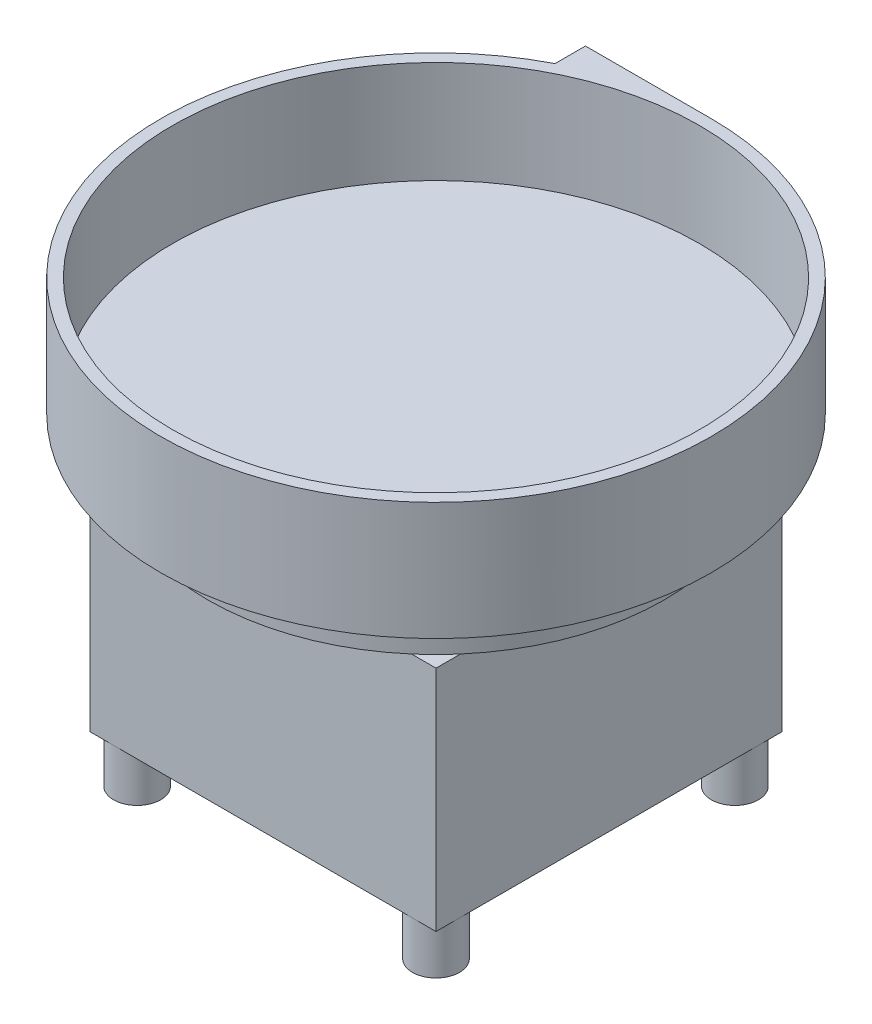
ISO-10303-21;
HEADER;
FILE_DESCRIPTION(('STEP AP214'),'2;1');
FILE_NAME('part.step','',(''),(''),'','','');
FILE_SCHEMA(('AUTOMOTIVE_DESIGN { 1 0 10303 214 1 1 1 1 }'));
ENDSEC;
DATA;
#1=APPLICATION_CONTEXT('core data for automotive mechanical design processes');
#2=APPLICATION_PROTOCOL_DEFINITION('international standard','automotive_design',2000,#1);
#3=PRODUCT_CONTEXT('',#1,'mechanical');
#4=PRODUCT('Part','Part','',(#3));
#5=PRODUCT_RELATED_PRODUCT_CATEGORY('part','',(#4));
#6=PRODUCT_DEFINITION_FORMATION('','',#4);
#7=PRODUCT_DEFINITION_CONTEXT('part definition',#1,'design');
#8=PRODUCT_DEFINITION('design','',#6,#7);
#9=PRODUCT_DEFINITION_SHAPE('','',#8);
#10=(LENGTH_UNIT() NAMED_UNIT(*) SI_UNIT(.MILLI.,.METRE.));
#11=(NAMED_UNIT(*) PLANE_ANGLE_UNIT() SI_UNIT($,.RADIAN.));
#12=(NAMED_UNIT(*) SI_UNIT($,.STERADIAN.) SOLID_ANGLE_UNIT());
#13=UNCERTAINTY_MEASURE_WITH_UNIT(LENGTH_MEASURE(1.E-05),#10,'distance_accuracy_value','');
#14=(GEOMETRIC_REPRESENTATION_CONTEXT(3) GLOBAL_UNCERTAINTY_ASSIGNED_CONTEXT((#13)) GLOBAL_UNIT_ASSIGNED_CONTEXT((#10,
#11,#12)) REPRESENTATION_CONTEXT('',''));
#15=CARTESIAN_POINT('',(0.,0.,0.));
#16=DIRECTION('',(0.,0.,1.));
#17=DIRECTION('',(1.,0.,0.));
#18=AXIS2_PLACEMENT_3D('',#15,#16,#17);
#19=CARTESIAN_POINT('',(0.,-234.95,0.));
#20=DIRECTION('',(0.,-1.,0.));
#21=DIRECTION('',(0.,0.,-1.));
#22=AXIS2_PLACEMENT_3D('',#19,#20,#21);
#23=PLANE('',#22);
#24=DIRECTION('',(-1.,0.,0.));
#25=VECTOR('',#24,1.);
#26=CARTESIAN_POINT('',(139.7,-234.95,139.7));
#27=LINE('',#26,#25);
#28=CARTESIAN_POINT('',(139.7,-234.95,139.7));
#29=VERTEX_POINT('',#28);
#30=CARTESIAN_POINT('',(120.65,-234.95,139.7));
#31=VERTEX_POINT('',#30);
#32=EDGE_CURVE('E160',#29,#31,#27,.T.);
#33=ORIENTED_EDGE('',*,*,#32,.T.);
#34=CARTESIAN_POINT('',(120.65,-234.95,120.65));
#35=DIRECTION('',(0.,-1.,0.));
#36=DIRECTION('',(0.,0.,-1.));
#37=AXIS2_PLACEMENT_3D('',#34,#35,#36);
#38=CIRCLE('',#37,19.05);
#39=CARTESIAN_POINT('',(139.7,-234.95,120.65));
#40=VERTEX_POINT('',#39);
#41=EDGE_CURVE('E57',#40,#31,#38,.T.);
#42=ORIENTED_EDGE('',*,*,#41,.F.);
#43=DIRECTION('',(0.,0.,1.));
#44=VECTOR('',#43,1.);
#45=CARTESIAN_POINT('',(139.7,-234.95,-139.7));
#46=LINE('',#45,#44);
#47=EDGE_CURVE('E157',#40,#29,#46,.T.);
#48=ORIENTED_EDGE('',*,*,#47,.T.);
#49=EDGE_LOOP('',(#33,#42,#48));
#50=FACE_BOUND('',#49,.T.);
#51=ADVANCED_FACE('F39',(#50),#23,.T.);
#52=CARTESIAN_POINT('',(139.7,-234.95,-120.65));
#53=VERTEX_POINT('',#52);
#54=EDGE_CURVE('E168',#53,#40,#46,.T.);
#55=ORIENTED_EDGE('',*,*,#54,.T.);
#56=EDGE_CURVE('E147',#31,#40,#38,.T.);
#57=ORIENTED_EDGE('',*,*,#56,.F.);
#58=CARTESIAN_POINT('',(-120.65,-234.95,139.7));
#59=VERTEX_POINT('',#58);
#60=EDGE_CURVE('E187',#31,#59,#27,.T.);
#61=ORIENTED_EDGE('',*,*,#60,.T.);
#62=CARTESIAN_POINT('',(-120.65,-234.95,120.65));
#63=DIRECTION('',(0.,-1.,0.));
#64=DIRECTION('',(0.,0.,-1.));
#65=AXIS2_PLACEMENT_3D('',#62,#63,#64);
#66=CIRCLE('',#65,19.05);
#67=CARTESIAN_POINT('',(-139.7,-234.95,120.65));
#68=VERTEX_POINT('',#67);
#69=EDGE_CURVE('E688',#68,#59,#66,.T.);
#70=ORIENTED_EDGE('',*,*,#69,.F.);
#71=DIRECTION('',(0.,0.,-1.));
#72=VECTOR('',#71,1.);
#73=CARTESIAN_POINT('',(-139.7,-234.95,-139.7));
#74=LINE('',#73,#72);
#75=CARTESIAN_POINT('',(-139.7,-234.95,-120.65));
#76=VERTEX_POINT('',#75);
#77=EDGE_CURVE('E440',#68,#76,#74,.T.);
#78=ORIENTED_EDGE('',*,*,#77,.T.);
#79=CARTESIAN_POINT('',(-120.65,-234.95,-120.65));
#80=DIRECTION('',(0.,-1.,0.));
#81=DIRECTION('',(0.,0.,-1.));
#82=AXIS2_PLACEMENT_3D('',#79,#80,#81);
#83=CIRCLE('',#82,19.05);
#84=CARTESIAN_POINT('',(-120.65,-234.95,-139.7));
#85=VERTEX_POINT('',#84);
#86=EDGE_CURVE('E51',#85,#76,#83,.T.);
#87=ORIENTED_EDGE('',*,*,#86,.F.);
#88=DIRECTION('',(1.,0.,0.));
#89=VECTOR('',#88,1.);
#90=CARTESIAN_POINT('',(139.7,-234.95,-139.7));
#91=LINE('',#90,#89);
#92=CARTESIAN_POINT('',(120.65,-234.95,-139.7));
#93=VERTEX_POINT('',#92);
#94=EDGE_CURVE('E444',#85,#93,#91,.T.);
#95=ORIENTED_EDGE('',*,*,#94,.T.);
#96=CARTESIAN_POINT('',(120.65,-234.95,-120.65));
#97=DIRECTION('',(0.,-1.,0.));
#98=DIRECTION('',(0.,0.,-1.));
#99=AXIS2_PLACEMENT_3D('',#96,#97,#98);
#100=CIRCLE('',#99,19.05);
#101=EDGE_CURVE('E64',#53,#93,#100,.T.);
#102=ORIENTED_EDGE('',*,*,#101,.F.);
#103=EDGE_LOOP('',(#55,#57,#61,#70,#78,#87,#95,#102));
#104=FACE_BOUND('',#103,.T.);
#105=ADVANCED_FACE('F176',(#104),#23,.T.);
#106=CARTESIAN_POINT('',(-139.7,-234.95,139.7));
#107=VERTEX_POINT('',#106);
#108=EDGE_CURVE('E436',#107,#68,#74,.T.);
#109=ORIENTED_EDGE('',*,*,#108,.T.);
#110=EDGE_CURVE('E437',#59,#68,#66,.T.);
#111=ORIENTED_EDGE('',*,*,#110,.F.);
#112=EDGE_CURVE('E180',#59,#107,#27,.T.);
#113=ORIENTED_EDGE('',*,*,#112,.T.);
#114=EDGE_LOOP('',(#109,#111,#113));
#115=FACE_BOUND('',#114,.T.);
#116=ADVANCED_FACE('F323',(#115),#23,.T.);
#117=CARTESIAN_POINT('',(139.7,-234.95,-139.7));
#118=VERTEX_POINT('',#117);
#119=EDGE_CURVE('E175',#118,#53,#46,.T.);
#120=ORIENTED_EDGE('',*,*,#119,.T.);
#121=EDGE_CURVE('E351',#93,#53,#100,.T.);
#122=ORIENTED_EDGE('',*,*,#121,.F.);
#123=EDGE_CURVE('E353',#93,#118,#91,.T.);
#124=ORIENTED_EDGE('',*,*,#123,.T.);
#125=EDGE_LOOP('',(#120,#122,#124));
#126=FACE_BOUND('',#125,.T.);
#127=ADVANCED_FACE('F330',(#126),#23,.T.);
#128=CARTESIAN_POINT('',(0.,-50.8,0.));
#129=DIRECTION('',(0.,-1.,0.));
#130=DIRECTION('',(0.,0.,-1.));
#131=AXIS2_PLACEMENT_3D('',#128,#129,#130);
#132=PLANE('',#131);
#133=DIRECTION('',(0.,0.,-1.));
#134=VECTOR('',#133,1.);
#135=CARTESIAN_POINT('',(-139.7,-50.8,-139.7));
#136=LINE('',#135,#134);
#137=CARTESIAN_POINT('',(-139.7,-50.8,119.979717035839));
#138=VERTEX_POINT('',#137);
#139=CARTESIAN_POINT('',(-139.7,-50.8,-119.979717035839));
#140=VERTEX_POINT('',#139);
#141=EDGE_CURVE('E49',#138,#140,#136,.T.);
#142=ORIENTED_EDGE('',*,*,#141,.F.);
#143=CARTESIAN_POINT('',(0.,-50.8,0.));
#144=DIRECTION('',(0.,-1.,0.));
#145=DIRECTION('',(0.,0.,-1.));
#146=AXIS2_PLACEMENT_3D('',#143,#144,#145);
#147=CIRCLE('',#146,184.15);
#148=EDGE_CURVE('E372',#138,#140,#147,.T.);
#149=ORIENTED_EDGE('',*,*,#148,.T.);
#150=EDGE_LOOP('',(#142,#149));
#151=FACE_BOUND('',#150,.T.);
#152=ADVANCED_FACE('F341',(#151),#132,.T.);
#153=DIRECTION('',(-1.,0.,0.));
#154=VECTOR('',#153,1.);
#155=CARTESIAN_POINT('',(139.7,-50.8,139.7));
#156=LINE('',#155,#154);
#157=CARTESIAN_POINT('',(119.979717035839,-50.8,139.7));
#158=VERTEX_POINT('',#157);
#159=CARTESIAN_POINT('',(-119.979717035839,-50.8,139.7));
#160=VERTEX_POINT('',#159);
#161=EDGE_CURVE('E210',#158,#160,#156,.T.);
#162=ORIENTED_EDGE('',*,*,#161,.F.);
#163=EDGE_CURVE('E382',#158,#160,#147,.T.);
#164=ORIENTED_EDGE('',*,*,#163,.T.);
#165=EDGE_LOOP('',(#162,#164));
#166=FACE_BOUND('',#165,.T.);
#167=ADVANCED_FACE('F347',(#166),#132,.T.);
#168=DIRECTION('',(0.,0.,1.));
#169=VECTOR('',#168,1.);
#170=CARTESIAN_POINT('',(139.7,-50.8,-139.7));
#171=LINE('',#170,#169);
#172=CARTESIAN_POINT('',(139.7,-50.8,-119.979717035839));
#173=VERTEX_POINT('',#172);
#174=CARTESIAN_POINT('',(139.7,-50.8,119.979717035839));
#175=VERTEX_POINT('',#174);
#176=EDGE_CURVE('E204',#173,#175,#171,.T.);
#177=ORIENTED_EDGE('',*,*,#176,.F.);
#178=EDGE_CURVE('E230',#173,#175,#147,.T.);
#179=ORIENTED_EDGE('',*,*,#178,.T.);
#180=EDGE_LOOP('',(#177,#179));
#181=FACE_BOUND('',#180,.T.);
#182=ADVANCED_FACE('F293',(#181),#132,.T.);
#183=CARTESIAN_POINT('',(0.,82.55,0.));
#184=DIRECTION('',(0.,1.,0.));
#185=DIRECTION('',(0.,0.,1.));
#186=AXIS2_PLACEMENT_3D('',#183,#184,#185);
#187=PLANE('',#186);
#188=CARTESIAN_POINT('',(0.,82.55,0.));
#189=DIRECTION('',(0.,1.,0.));
#190=DIRECTION('',(0.,0.,1.));
#191=AXIS2_PLACEMENT_3D('',#188,#189,#190);
#192=CIRCLE('',#191,222.25);
#193=CARTESIAN_POINT('',(-101.6,82.55,-197.667656686672));
#194=VERTEX_POINT('',#193);
#195=CARTESIAN_POINT('',(0.,82.55,-222.25));
#196=VERTEX_POINT('',#195);
#197=EDGE_CURVE('E251',#194,#196,#192,.T.);
#198=ORIENTED_EDGE('',*,*,#197,.T.);
#199=DIRECTION('',(-1.,0.,0.));
#200=VECTOR('',#199,1.);
#201=CARTESIAN_POINT('',(0.,82.55,-222.25));
#202=LINE('',#201,#200);
#203=CARTESIAN_POINT('',(-101.6,82.55,-222.25));
#204=VERTEX_POINT('',#203);
#205=EDGE_CURVE('E255',#196,#204,#202,.T.);
#206=ORIENTED_EDGE('',*,*,#205,.T.);
#207=DIRECTION('',(0.,0.,1.));
#208=VECTOR('',#207,1.);
#209=CARTESIAN_POINT('',(-101.6,82.55,-222.25));
#210=LINE('',#209,#208);
#211=EDGE_CURVE('E259',#204,#194,#210,.T.);
#212=ORIENTED_EDGE('',*,*,#211,.T.);
#213=EDGE_LOOP('',(#198,#206,#212));
#214=FACE_BOUND('',#213,.T.);
#215=CARTESIAN_POINT('',(0.,82.55,0.));
#216=DIRECTION('',(0.,1.,0.));
#217=DIRECTION('',(0.,0.,1.));
#218=AXIS2_PLACEMENT_3D('',#215,#216,#217);
#219=CIRCLE('',#218,212.725);
#220=CARTESIAN_POINT('',(0.,82.55,212.725));
#221=VERTEX_POINT('',#220);
#222=EDGE_CURVE('E243',#221,#221,#219,.T.);
#223=ORIENTED_EDGE('',*,*,#222,.F.);
#224=EDGE_LOOP('',(#223));
#225=FACE_BOUND('',#224,.T.);
#226=ADVANCED_FACE('F290',(#214,#225),#187,.T.);
#227=CARTESIAN_POINT('',(0.,0.,0.));
#228=DIRECTION('',(0.,1.,0.));
#229=DIRECTION('',(0.,0.,1.));
#230=AXIS2_PLACEMENT_3D('',#227,#228,#229);
#231=PLANE('',#230);
#232=CARTESIAN_POINT('',(0.,0.,0.));
#233=DIRECTION('',(0.,-1.,0.));
#234=DIRECTION('',(0.,0.,-1.));
#235=AXIS2_PLACEMENT_3D('',#232,#233,#234);
#236=CIRCLE('',#235,222.25);
#237=CARTESIAN_POINT('',(-101.6,0.,-197.667656686672));
#238=VERTEX_POINT('',#237);
#239=CARTESIAN_POINT('',(0.,0.,-222.25));
#240=VERTEX_POINT('',#239);
#241=EDGE_CURVE('E235',#238,#240,#236,.T.);
#242=ORIENTED_EDGE('',*,*,#241,.F.);
#243=DIRECTION('',(0.,0.,1.));
#244=VECTOR('',#243,1.);
#245=CARTESIAN_POINT('',(-101.6,0.,-222.25));
#246=LINE('',#245,#244);
#247=CARTESIAN_POINT('',(-101.6,0.,-222.25));
#248=VERTEX_POINT('',#247);
#249=EDGE_CURVE('E256',#248,#238,#246,.T.);
#250=ORIENTED_EDGE('',*,*,#249,.F.);
#251=DIRECTION('',(-1.,0.,0.));
#252=VECTOR('',#251,1.);
#253=CARTESIAN_POINT('',(0.,0.,-222.25));
#254=LINE('',#253,#252);
#255=EDGE_CURVE('E247',#240,#248,#254,.T.);
#256=ORIENTED_EDGE('',*,*,#255,.F.);
#257=EDGE_LOOP('',(#242,#250,#256));
#258=FACE_BOUND('',#257,.T.);
#259=ADVANCED_FACE('F285',(#258),#231,.F.);
#260=CARTESIAN_POINT('',(0.,82.55,0.));
#261=DIRECTION('',(0.,-1.,0.));
#262=DIRECTION('',(0.,0.,-1.));
#263=AXIS2_PLACEMENT_3D('',#260,#261,#262);
#264=CYLINDRICAL_SURFACE('',#263,222.25);
#265=DIRECTION('',(0.,-1.,0.));
#266=VECTOR('',#265,1.);
#267=CARTESIAN_POINT('',(-101.6,82.55,-197.667656686672));
#268=LINE('',#267,#266);
#269=EDGE_CURVE('E262',#194,#238,#268,.T.);
#270=ORIENTED_EDGE('',*,*,#269,.T.);
#271=ORIENTED_EDGE('',*,*,#241,.T.);
#272=DIRECTION('',(0.,-1.,0.));
#273=VECTOR('',#272,1.);
#274=CARTESIAN_POINT('',(0.,82.55,-222.25));
#275=LINE('',#274,#273);
#276=EDGE_CURVE('E43',#196,#240,#275,.T.);
#277=ORIENTED_EDGE('',*,*,#276,.F.);
#278=ORIENTED_EDGE('',*,*,#197,.F.);
#279=EDGE_LOOP('',(#270,#271,#277,#278));
#280=FACE_BOUND('',#279,.T.);
#281=CARTESIAN_POINT('',(0.,-12.7,0.));
#282=DIRECTION('',(0.,-1.,0.));
#283=DIRECTION('',(0.,0.,-1.));
#284=AXIS2_PLACEMENT_3D('',#281,#282,#283);
#285=CIRCLE('',#284,222.25);
#286=CARTESIAN_POINT('',(0.,-12.7,-222.25));
#287=VERTEX_POINT('',#286);
#288=EDGE_CURVE('E229',#287,#287,#285,.T.);
#289=ORIENTED_EDGE('',*,*,#288,.F.);
#290=EDGE_LOOP('',(#289));
#291=FACE_BOUND('',#290,.T.);
#292=ADVANCED_FACE('F41',(#280,#291),#264,.T.);
#293=CARTESIAN_POINT('',(0.,82.55,-222.25));
#294=DIRECTION('',(0.,0.,1.));
#295=DIRECTION('',(1.,0.,0.));
#296=AXIS2_PLACEMENT_3D('',#293,#294,#295);
#297=PLANE('',#296);
#298=ORIENTED_EDGE('',*,*,#255,.T.);
#299=DIRECTION('',(0.,-1.,0.));
#300=VECTOR('',#299,1.);
#301=CARTESIAN_POINT('',(-101.6,82.55,-222.25));
#302=LINE('',#301,#300);
#303=EDGE_CURVE('E270',#204,#248,#302,.T.);
#304=ORIENTED_EDGE('',*,*,#303,.F.);
#305=ORIENTED_EDGE('',*,*,#205,.F.);
#306=ORIENTED_EDGE('',*,*,#276,.T.);
#307=EDGE_LOOP('',(#298,#304,#305,#306));
#308=FACE_BOUND('',#307,.T.);
#309=ADVANCED_FACE('F281',(#308),#297,.F.);
#310=CARTESIAN_POINT('',(-101.6,82.55,-222.25));
#311=DIRECTION('',(1.,0.,0.));
#312=DIRECTION('',(0.,0.,-1.));
#313=AXIS2_PLACEMENT_3D('',#310,#311,#312);
#314=PLANE('',#313);
#315=ORIENTED_EDGE('',*,*,#249,.T.);
#316=ORIENTED_EDGE('',*,*,#269,.F.);
#317=ORIENTED_EDGE('',*,*,#211,.F.);
#318=ORIENTED_EDGE('',*,*,#303,.T.);
#319=EDGE_LOOP('',(#315,#316,#317,#318));
#320=FACE_BOUND('',#319,.T.);
#321=ADVANCED_FACE('F288',(#320),#314,.F.);
#322=CARTESIAN_POINT('',(0.,82.55,0.));
#323=DIRECTION('',(0.,-1.,0.));
#324=DIRECTION('',(0.,0.,-1.));
#325=AXIS2_PLACEMENT_3D('',#322,#323,#324);
#326=CYLINDRICAL_SURFACE('',#325,212.725);
#327=ORIENTED_EDGE('',*,*,#222,.T.);
#328=EDGE_LOOP('',(#327));
#329=FACE_BOUND('',#328,.T.);
#330=CARTESIAN_POINT('',(0.,0.,0.));
#331=DIRECTION('',(0.,1.,0.));
#332=DIRECTION('',(0.,0.,1.));
#333=AXIS2_PLACEMENT_3D('',#330,#331,#332);
#334=CIRCLE('',#333,212.725);
#335=CARTESIAN_POINT('',(0.,0.,212.725));
#336=VERTEX_POINT('',#335);
#337=EDGE_CURVE('E239',#336,#336,#334,.T.);
#338=ORIENTED_EDGE('',*,*,#337,.F.);
#339=EDGE_LOOP('',(#338));
#340=FACE_BOUND('',#339,.T.);
#341=ADVANCED_FACE('F297',(#329,#340),#326,.F.);
#342=CARTESIAN_POINT('',(0.,-12.7,0.));
#343=DIRECTION('',(0.,-1.,0.));
#344=DIRECTION('',(0.,0.,-1.));
#345=AXIS2_PLACEMENT_3D('',#342,#343,#344);
#346=PLANE('',#345);
#347=CARTESIAN_POINT('',(0.,-12.7,0.));
#348=DIRECTION('',(0.,-1.,0.));
#349=DIRECTION('',(0.,0.,-1.));
#350=AXIS2_PLACEMENT_3D('',#347,#348,#349);
#351=CIRCLE('',#350,184.15);
#352=CARTESIAN_POINT('',(0.,-12.7,-184.15));
#353=VERTEX_POINT('',#352);
#354=EDGE_CURVE('E231',#353,#353,#351,.T.);
#355=ORIENTED_EDGE('',*,*,#354,.F.);
#356=EDGE_LOOP('',(#355));
#357=FACE_BOUND('',#356,.T.);
#358=ORIENTED_EDGE('',*,*,#288,.T.);
#359=EDGE_LOOP('',(#358));
#360=FACE_BOUND('',#359,.T.);
#361=ADVANCED_FACE('F300',(#357,#360),#346,.T.);
#362=CARTESIAN_POINT('',(0.,0.,0.));
#363=DIRECTION('',(0.,-1.,0.));
#364=DIRECTION('',(0.,0.,-1.));
#365=AXIS2_PLACEMENT_3D('',#362,#363,#364);
#366=PLANE('',#365);
#367=ORIENTED_EDGE('',*,*,#337,.T.);
#368=EDGE_LOOP('',(#367));
#369=FACE_BOUND('',#368,.T.);
#370=ADVANCED_FACE('F304',(#369),#366,.F.);
#371=CARTESIAN_POINT('',(0.,-50.8,0.));
#372=DIRECTION('',(0.,1.,0.));
#373=DIRECTION('',(0.,0.,1.));
#374=AXIS2_PLACEMENT_3D('',#371,#372,#373);
#375=CYLINDRICAL_SURFACE('',#374,184.15);
#376=CARTESIAN_POINT('',(119.979717035839,-50.8,-139.7));
#377=VERTEX_POINT('',#376);
#378=EDGE_CURVE('E225',#377,#173,#147,.T.);
#379=ORIENTED_EDGE('',*,*,#378,.F.);
#380=CARTESIAN_POINT('',(-119.979717035839,-50.8,-139.7));
#381=VERTEX_POINT('',#380);
#382=EDGE_CURVE('E224',#381,#377,#147,.T.);
#383=ORIENTED_EDGE('',*,*,#382,.F.);
#384=EDGE_CURVE('E370',#140,#381,#147,.T.);
#385=ORIENTED_EDGE('',*,*,#384,.F.);
#386=ORIENTED_EDGE('',*,*,#148,.F.);
#387=EDGE_CURVE('E378',#160,#138,#147,.T.);
#388=ORIENTED_EDGE('',*,*,#387,.F.);
#389=ORIENTED_EDGE('',*,*,#163,.F.);
#390=EDGE_CURVE('E388',#175,#158,#147,.T.);
#391=ORIENTED_EDGE('',*,*,#390,.F.);
#392=ORIENTED_EDGE('',*,*,#178,.F.);
#393=EDGE_LOOP('',(#379,#383,#385,#386,#388,#389,#391,#392));
#394=FACE_BOUND('',#393,.T.);
#395=ORIENTED_EDGE('',*,*,#354,.T.);
#396=EDGE_LOOP('',(#395));
#397=FACE_BOUND('',#396,.T.);
#398=ADVANCED_FACE('F306',(#394,#397),#375,.T.);
#399=DIRECTION('',(1.,0.,0.));
#400=VECTOR('',#399,1.);
#401=CARTESIAN_POINT('',(139.7,-50.8,-139.7));
#402=LINE('',#401,#400);
#403=EDGE_CURVE('E199',#381,#377,#402,.T.);
#404=ORIENTED_EDGE('',*,*,#403,.F.);
#405=ORIENTED_EDGE('',*,*,#382,.T.);
#406=EDGE_LOOP('',(#404,#405));
#407=FACE_BOUND('',#406,.T.);
#408=ADVANCED_FACE('F312',(#407),#132,.T.);
#409=CARTESIAN_POINT('',(0.,-50.8,0.));
#410=DIRECTION('',(0.,-1.,0.));
#411=DIRECTION('',(0.,0.,-1.));
#412=AXIS2_PLACEMENT_3D('',#409,#410,#411);
#413=PLANE('',#412);
#414=CARTESIAN_POINT('',(139.7,-50.8,-139.7));
#415=VERTEX_POINT('',#414);
#416=EDGE_CURVE('E192',#377,#415,#402,.T.);
#417=ORIENTED_EDGE('',*,*,#416,.F.);
#418=ORIENTED_EDGE('',*,*,#378,.T.);
#419=EDGE_CURVE('E200',#415,#173,#171,.T.);
#420=ORIENTED_EDGE('',*,*,#419,.F.);
#421=EDGE_LOOP('',(#417,#418,#420));
#422=FACE_BOUND('',#421,.T.);
#423=ADVANCED_FACE('F360',(#422),#413,.F.);
#424=CARTESIAN_POINT('',(139.7,-50.8,139.7));
#425=VERTEX_POINT('',#424);
#426=EDGE_CURVE('E198',#175,#425,#171,.T.);
#427=ORIENTED_EDGE('',*,*,#426,.F.);
#428=ORIENTED_EDGE('',*,*,#390,.T.);
#429=EDGE_CURVE('E205',#425,#158,#156,.T.);
#430=ORIENTED_EDGE('',*,*,#429,.F.);
#431=EDGE_LOOP('',(#427,#428,#430));
#432=FACE_BOUND('',#431,.T.);
#433=ADVANCED_FACE('F398',(#432),#413,.F.);
#434=CARTESIAN_POINT('',(-139.7,-50.8,139.7));
#435=VERTEX_POINT('',#434);
#436=EDGE_CURVE('E203',#160,#435,#156,.T.);
#437=ORIENTED_EDGE('',*,*,#436,.F.);
#438=ORIENTED_EDGE('',*,*,#387,.T.);
#439=EDGE_CURVE('E188',#435,#138,#136,.T.);
#440=ORIENTED_EDGE('',*,*,#439,.F.);
#441=EDGE_LOOP('',(#437,#438,#440));
#442=FACE_BOUND('',#441,.T.);
#443=ADVANCED_FACE('F456',(#442),#413,.F.);
#444=CARTESIAN_POINT('',(-139.7,-50.8,-139.7));
#445=VERTEX_POINT('',#444);
#446=EDGE_CURVE('E193',#140,#445,#136,.T.);
#447=ORIENTED_EDGE('',*,*,#446,.F.);
#448=ORIENTED_EDGE('',*,*,#384,.T.);
#449=EDGE_CURVE('E194',#445,#381,#402,.T.);
#450=ORIENTED_EDGE('',*,*,#449,.F.);
#451=EDGE_LOOP('',(#447,#448,#450));
#452=FACE_BOUND('',#451,.T.);
#453=ADVANCED_FACE('F414',(#452),#413,.F.);
#454=CARTESIAN_POINT('',(-139.7,-234.95,-139.7));
#455=DIRECTION('',(1.,0.,0.));
#456=DIRECTION('',(0.,0.,-1.));
#457=AXIS2_PLACEMENT_3D('',#454,#455,#456);
#458=PLANE('',#457);
#459=ORIENTED_EDGE('',*,*,#439,.T.);
#460=ORIENTED_EDGE('',*,*,#141,.T.);
#461=ORIENTED_EDGE('',*,*,#446,.T.);
#462=DIRECTION('',(0.,1.,0.));
#463=VECTOR('',#462,1.);
#464=CARTESIAN_POINT('',(-139.7,-234.95,-139.7));
#465=LINE('',#464,#463);
#466=CARTESIAN_POINT('',(-139.7,-234.95,-139.7));
#467=VERTEX_POINT('',#466);
#468=EDGE_CURVE('E220',#467,#445,#465,.T.);
#469=ORIENTED_EDGE('',*,*,#468,.F.);
#470=EDGE_CURVE('E209',#76,#467,#74,.T.);
#471=ORIENTED_EDGE('',*,*,#470,.F.);
#472=ORIENTED_EDGE('',*,*,#77,.F.);
#473=ORIENTED_EDGE('',*,*,#108,.F.);
#474=DIRECTION('',(0.,1.,0.));
#475=VECTOR('',#474,1.);
#476=CARTESIAN_POINT('',(-139.7,-234.95,139.7));
#477=LINE('',#476,#475);
#478=EDGE_CURVE('E186',#107,#435,#477,.T.);
#479=ORIENTED_EDGE('',*,*,#478,.T.);
#480=EDGE_LOOP('',(#459,#460,#461,#469,#471,#472,#473,#479));
#481=FACE_BOUND('',#480,.T.);
#482=ADVANCED_FACE('F407',(#481),#458,.F.);
#483=CARTESIAN_POINT('',(139.7,-234.95,-139.7));
#484=DIRECTION('',(0.,0.,1.));
#485=DIRECTION('',(1.,0.,0.));
#486=AXIS2_PLACEMENT_3D('',#483,#484,#485);
#487=PLANE('',#486);
#488=ORIENTED_EDGE('',*,*,#449,.T.);
#489=ORIENTED_EDGE('',*,*,#403,.T.);
#490=ORIENTED_EDGE('',*,*,#416,.T.);
#491=DIRECTION('',(0.,1.,0.));
#492=VECTOR('',#491,1.);
#493=CARTESIAN_POINT('',(139.7,-234.95,-139.7));
#494=LINE('',#493,#492);
#495=EDGE_CURVE('E216',#118,#415,#494,.T.);
#496=ORIENTED_EDGE('',*,*,#495,.F.);
#497=ORIENTED_EDGE('',*,*,#123,.F.);
#498=ORIENTED_EDGE('',*,*,#94,.F.);
#499=EDGE_CURVE('E173',#467,#85,#91,.T.);
#500=ORIENTED_EDGE('',*,*,#499,.F.);
#501=ORIENTED_EDGE('',*,*,#468,.T.);
#502=EDGE_LOOP('',(#488,#489,#490,#496,#497,#498,#500,#501));
#503=FACE_BOUND('',#502,.T.);
#504=ADVANCED_FACE('F405',(#503),#487,.F.);
#505=CARTESIAN_POINT('',(139.7,-234.95,-139.7));
#506=DIRECTION('',(-1.,0.,0.));
#507=DIRECTION('',(0.,0.,1.));
#508=AXIS2_PLACEMENT_3D('',#505,#506,#507);
#509=PLANE('',#508);
#510=ORIENTED_EDGE('',*,*,#419,.T.);
#511=ORIENTED_EDGE('',*,*,#176,.T.);
#512=ORIENTED_EDGE('',*,*,#426,.T.);
#513=DIRECTION('',(0.,1.,0.));
#514=VECTOR('',#513,1.);
#515=CARTESIAN_POINT('',(139.7,-234.95,139.7));
#516=LINE('',#515,#514);
#517=EDGE_CURVE('E171',#29,#425,#516,.T.);
#518=ORIENTED_EDGE('',*,*,#517,.F.);
#519=ORIENTED_EDGE('',*,*,#47,.F.);
#520=ORIENTED_EDGE('',*,*,#54,.F.);
#521=ORIENTED_EDGE('',*,*,#119,.F.);
#522=ORIENTED_EDGE('',*,*,#495,.T.);
#523=EDGE_LOOP('',(#510,#511,#512,#518,#519,#520,#521,#522));
#524=FACE_BOUND('',#523,.T.);
#525=ADVANCED_FACE('F166',(#524),#509,.F.);
#526=CARTESIAN_POINT('',(139.7,-234.95,139.7));
#527=DIRECTION('',(0.,0.,-1.));
#528=DIRECTION('',(-1.,0.,0.));
#529=AXIS2_PLACEMENT_3D('',#526,#527,#528);
#530=PLANE('',#529);
#531=ORIENTED_EDGE('',*,*,#429,.T.);
#532=ORIENTED_EDGE('',*,*,#161,.T.);
#533=ORIENTED_EDGE('',*,*,#436,.T.);
#534=ORIENTED_EDGE('',*,*,#478,.F.);
#535=ORIENTED_EDGE('',*,*,#112,.F.);
#536=ORIENTED_EDGE('',*,*,#60,.F.);
#537=ORIENTED_EDGE('',*,*,#32,.F.);
#538=ORIENTED_EDGE('',*,*,#517,.T.);
#539=EDGE_LOOP('',(#531,#532,#533,#534,#535,#536,#537,#538));
#540=FACE_BOUND('',#539,.T.);
#541=ADVANCED_FACE('F328',(#540),#530,.F.);
#542=EDGE_CURVE('E11',#76,#85,#83,.T.);
#543=ORIENTED_EDGE('',*,*,#542,.F.);
#544=ORIENTED_EDGE('',*,*,#470,.T.);
#545=ORIENTED_EDGE('',*,*,#499,.T.);
#546=EDGE_LOOP('',(#543,#544,#545));
#547=FACE_BOUND('',#546,.T.);
#548=ADVANCED_FACE('F319',(#547),#23,.T.);
#549=CARTESIAN_POINT('',(-120.65,-273.05,-120.65));
#550=DIRECTION('',(0.,1.,0.));
#551=DIRECTION('',(0.,0.,1.));
#552=AXIS2_PLACEMENT_3D('',#549,#550,#551);
#553=CYLINDRICAL_SURFACE('',#552,19.05);
#554=CARTESIAN_POINT('',(-120.65,-273.05,-120.65));
#555=DIRECTION('',(0.,-1.,0.));
#556=DIRECTION('',(0.,0.,-1.));
#557=AXIS2_PLACEMENT_3D('',#554,#555,#556);
#558=CIRCLE('',#557,19.05);
#559=CARTESIAN_POINT('',(-120.65,-273.05,-139.7));
#560=VERTEX_POINT('',#559);
#561=EDGE_CURVE('E454',#560,#560,#558,.T.);
#562=ORIENTED_EDGE('',*,*,#561,.F.);
#563=EDGE_LOOP('',(#562));
#564=FACE_BOUND('',#563,.T.);
#565=ORIENTED_EDGE('',*,*,#86,.T.);
#566=ORIENTED_EDGE('',*,*,#542,.T.);
#567=EDGE_LOOP('',(#565,#566));
#568=FACE_BOUND('',#567,.T.);
#569=ADVANCED_FACE('F327',(#564,#568),#553,.T.);
#570=CARTESIAN_POINT('',(-120.65,-273.05,-120.65));
#571=DIRECTION('',(0.,-1.,0.));
#572=DIRECTION('',(0.,0.,-1.));
#573=AXIS2_PLACEMENT_3D('',#570,#571,#572);
#574=PLANE('',#573);
#575=ORIENTED_EDGE('',*,*,#561,.T.);
#576=EDGE_LOOP('',(#575));
#577=FACE_BOUND('',#576,.T.);
#578=ADVANCED_FACE('F335',(#577),#574,.T.);
#579=CARTESIAN_POINT('',(-120.65,-273.05,120.65));
#580=DIRECTION('',(0.,1.,0.));
#581=DIRECTION('',(0.,0.,1.));
#582=AXIS2_PLACEMENT_3D('',#579,#580,#581);
#583=CYLINDRICAL_SURFACE('',#582,19.05);
#584=CARTESIAN_POINT('',(-120.65,-273.05,120.65));
#585=DIRECTION('',(0.,-1.,0.));
#586=DIRECTION('',(0.,0.,-1.));
#587=AXIS2_PLACEMENT_3D('',#584,#585,#586);
#588=CIRCLE('',#587,19.05);
#589=CARTESIAN_POINT('',(-120.65,-273.05,101.6));
#590=VERTEX_POINT('',#589);
#591=EDGE_CURVE('E691',#590,#590,#588,.T.);
#592=ORIENTED_EDGE('',*,*,#591,.F.);
#593=EDGE_LOOP('',(#592));
#594=FACE_BOUND('',#593,.T.);
#595=ORIENTED_EDGE('',*,*,#110,.T.);
#596=ORIENTED_EDGE('',*,*,#69,.T.);
#597=EDGE_LOOP('',(#595,#596));
#598=FACE_BOUND('',#597,.T.);
#599=ADVANCED_FACE('F615',(#594,#598),#583,.T.);
#600=CARTESIAN_POINT('',(-120.65,-273.05,120.65));
#601=DIRECTION('',(0.,-1.,0.));
#602=DIRECTION('',(0.,0.,-1.));
#603=AXIS2_PLACEMENT_3D('',#600,#601,#602);
#604=PLANE('',#603);
#605=ORIENTED_EDGE('',*,*,#591,.T.);
#606=EDGE_LOOP('',(#605));
#607=FACE_BOUND('',#606,.T.);
#608=ADVANCED_FACE('F624',(#607),#604,.T.);
#609=CARTESIAN_POINT('',(120.65,-273.05,-120.65));
#610=DIRECTION('',(0.,1.,0.));
#611=DIRECTION('',(0.,0.,1.));
#612=AXIS2_PLACEMENT_3D('',#609,#610,#611);
#613=CYLINDRICAL_SURFACE('',#612,19.05);
#614=CARTESIAN_POINT('',(120.65,-273.05,-120.65));
#615=DIRECTION('',(0.,-1.,0.));
#616=DIRECTION('',(0.,0.,-1.));
#617=AXIS2_PLACEMENT_3D('',#614,#615,#616);
#618=CIRCLE('',#617,19.05);
#619=CARTESIAN_POINT('',(120.65,-273.05,-139.7));
#620=VERTEX_POINT('',#619);
#621=EDGE_CURVE('E685',#620,#620,#618,.T.);
#622=ORIENTED_EDGE('',*,*,#621,.F.);
#623=EDGE_LOOP('',(#622));
#624=FACE_BOUND('',#623,.T.);
#625=ORIENTED_EDGE('',*,*,#121,.T.);
#626=ORIENTED_EDGE('',*,*,#101,.T.);
#627=EDGE_LOOP('',(#625,#626));
#628=FACE_BOUND('',#627,.T.);
#629=ADVANCED_FACE('F633',(#624,#628),#613,.T.);
#630=CARTESIAN_POINT('',(120.65,-273.05,-120.65));
#631=DIRECTION('',(0.,-1.,0.));
#632=DIRECTION('',(0.,0.,-1.));
#633=AXIS2_PLACEMENT_3D('',#630,#631,#632);
#634=PLANE('',#633);
#635=ORIENTED_EDGE('',*,*,#621,.T.);
#636=EDGE_LOOP('',(#635));
#637=FACE_BOUND('',#636,.T.);
#638=ADVANCED_FACE('F642',(#637),#634,.T.);
#639=CARTESIAN_POINT('',(120.65,-273.05,120.65));
#640=DIRECTION('',(0.,1.,0.));
#641=DIRECTION('',(0.,0.,1.));
#642=AXIS2_PLACEMENT_3D('',#639,#640,#641);
#643=CYLINDRICAL_SURFACE('',#642,19.05);
#644=CARTESIAN_POINT('',(120.65,-273.05,120.65));
#645=DIRECTION('',(0.,-1.,0.));
#646=DIRECTION('',(0.,0.,-1.));
#647=AXIS2_PLACEMENT_3D('',#644,#645,#646);
#648=CIRCLE('',#647,19.05);
#649=CARTESIAN_POINT('',(120.65,-273.05,101.6));
#650=VERTEX_POINT('',#649);
#651=EDGE_CURVE('E162',#650,#650,#648,.T.);
#652=ORIENTED_EDGE('',*,*,#651,.F.);
#653=EDGE_LOOP('',(#652));
#654=FACE_BOUND('',#653,.T.);
#655=ORIENTED_EDGE('',*,*,#41,.T.);
#656=ORIENTED_EDGE('',*,*,#56,.T.);
#657=EDGE_LOOP('',(#655,#656));
#658=FACE_BOUND('',#657,.T.);
#659=ADVANCED_FACE('F148',(#654,#658),#643,.T.);
#660=CARTESIAN_POINT('',(120.65,-273.05,120.65));
#661=DIRECTION('',(0.,-1.,0.));
#662=DIRECTION('',(0.,0.,-1.));
#663=AXIS2_PLACEMENT_3D('',#660,#661,#662);
#664=PLANE('',#663);
#665=ORIENTED_EDGE('',*,*,#651,.T.);
#666=EDGE_LOOP('',(#665));
#667=FACE_BOUND('',#666,.T.);
#668=ADVANCED_FACE('F659',(#667),#664,.T.);
#669=CLOSED_SHELL('',(#51,#105,#116,#127,#152,#167,#182,#226,#259,#292,#309,#321,#341,#361,#370,
#398,#408,#423,#433,#443,#453,#482,#504,#525,#541,#548,#569,#578,#599,#608,#629,#638,#659,#668));
#670=MANIFOLD_SOLID_BREP('B2',#669);
#671=ADVANCED_BREP_SHAPE_REPRESENTATION('',(#18,#670),#14);
#672=SHAPE_DEFINITION_REPRESENTATION(#9,#671);
ENDSEC;
END-ISO-10303-21;
